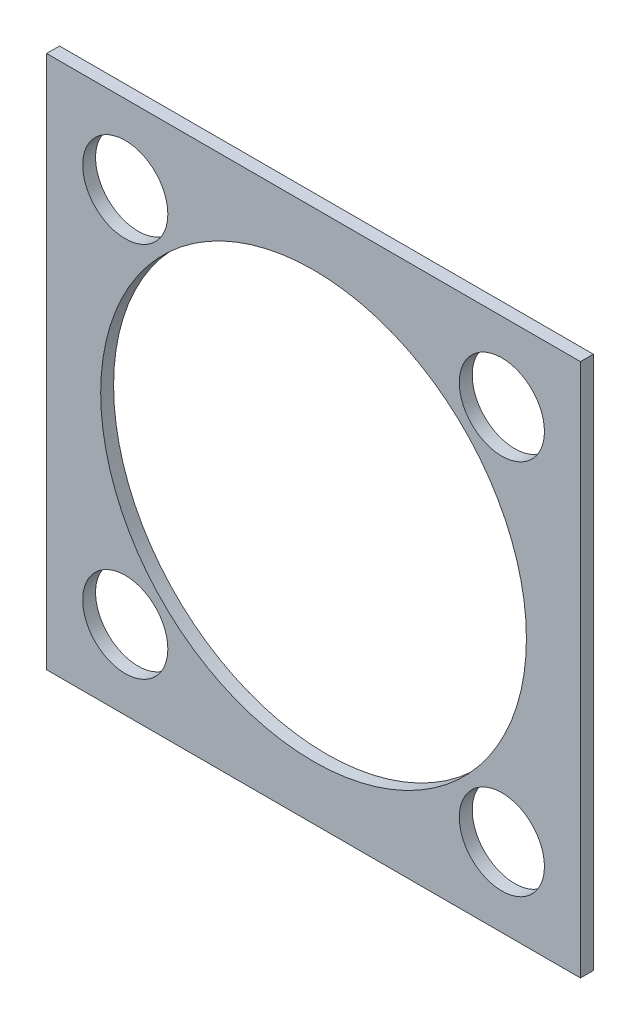
ISO-10303-21;
HEADER;
FILE_DESCRIPTION(('STEP AP214'),'2;1');
FILE_NAME('part.step','',(''),(''),'','','');
FILE_SCHEMA(('AUTOMOTIVE_DESIGN { 1 0 10303 214 1 1 1 1 }'));
ENDSEC;
DATA;
#1=APPLICATION_CONTEXT('core data for automotive mechanical design processes');
#2=APPLICATION_PROTOCOL_DEFINITION('international standard','automotive_design',2000,#1);
#3=PRODUCT_CONTEXT('',#1,'mechanical');
#4=PRODUCT('Part','Part','',(#3));
#5=PRODUCT_RELATED_PRODUCT_CATEGORY('part','',(#4));
#6=PRODUCT_DEFINITION_FORMATION('','',#4);
#7=PRODUCT_DEFINITION_CONTEXT('part definition',#1,'design');
#8=PRODUCT_DEFINITION('design','',#6,#7);
#9=PRODUCT_DEFINITION_SHAPE('','',#8);
#10=(LENGTH_UNIT() NAMED_UNIT(*) SI_UNIT(.MILLI.,.METRE.));
#11=(NAMED_UNIT(*) PLANE_ANGLE_UNIT() SI_UNIT($,.RADIAN.));
#12=(NAMED_UNIT(*) SI_UNIT($,.STERADIAN.) SOLID_ANGLE_UNIT());
#13=UNCERTAINTY_MEASURE_WITH_UNIT(LENGTH_MEASURE(1.E-05),#10,'distance_accuracy_value','');
#14=(GEOMETRIC_REPRESENTATION_CONTEXT(3) GLOBAL_UNCERTAINTY_ASSIGNED_CONTEXT((#13)) GLOBAL_UNIT_ASSIGNED_CONTEXT((#10,
#11,#12)) REPRESENTATION_CONTEXT('',''));
#15=CARTESIAN_POINT('',(0.,0.,0.));
#16=DIRECTION('',(0.,0.,1.));
#17=DIRECTION('',(1.,0.,0.));
#18=AXIS2_PLACEMENT_3D('',#15,#16,#17);
#19=CARTESIAN_POINT('',(-20.701,20.701,-0.499999));
#20=DIRECTION('',(-1.,0.,0.));
#21=DIRECTION('',(0.,0.,1.));
#22=AXIS2_PLACEMENT_3D('',#19,#20,#21);
#23=PLANE('',#22);
#24=DIRECTION('',(0.,0.,1.));
#25=VECTOR('',#24,1.);
#26=CARTESIAN_POINT('',(-20.701,-20.701,-0.499999));
#27=LINE('',#26,#25);
#28=CARTESIAN_POINT('',(-20.701,-20.701,-0.499999));
#29=VERTEX_POINT('',#28);
#30=CARTESIAN_POINT('',(-20.701,-20.701,0.499999));
#31=VERTEX_POINT('',#30);
#32=EDGE_CURVE('E38',#29,#31,#27,.T.);
#33=ORIENTED_EDGE('',*,*,#32,.T.);
#34=DIRECTION('',(0.,-1.,0.));
#35=VECTOR('',#34,1.);
#36=CARTESIAN_POINT('',(-20.701,20.701,0.499999));
#37=LINE('',#36,#35);
#38=CARTESIAN_POINT('',(-20.701,20.701,0.499999));
#39=VERTEX_POINT('',#38);
#40=EDGE_CURVE('E75',#39,#31,#37,.T.);
#41=ORIENTED_EDGE('',*,*,#40,.F.);
#42=DIRECTION('',(0.,0.,1.));
#43=VECTOR('',#42,1.);
#44=CARTESIAN_POINT('',(-20.701,20.701,-0.499999));
#45=LINE('',#44,#43);
#46=CARTESIAN_POINT('',(-20.701,20.701,-0.499999));
#47=VERTEX_POINT('',#46);
#48=EDGE_CURVE('E11',#47,#39,#45,.T.);
#49=ORIENTED_EDGE('',*,*,#48,.F.);
#50=DIRECTION('',(0.,-1.,0.));
#51=VECTOR('',#50,1.);
#52=CARTESIAN_POINT('',(-20.701,20.701,-0.499999));
#53=LINE('',#52,#51);
#54=EDGE_CURVE('E76',#47,#29,#53,.T.);
#55=ORIENTED_EDGE('',*,*,#54,.T.);
#56=EDGE_LOOP('',(#33,#41,#49,#55));
#57=FACE_BOUND('',#56,.T.);
#58=ADVANCED_FACE('F35',(#57),#23,.T.);
#59=CARTESIAN_POINT('',(-20.701,20.701,-0.499999));
#60=DIRECTION('',(0.,1.,0.));
#61=DIRECTION('',(0.,0.,1.));
#62=AXIS2_PLACEMENT_3D('',#59,#60,#61);
#63=PLANE('',#62);
#64=ORIENTED_EDGE('',*,*,#48,.T.);
#65=DIRECTION('',(-1.,0.,0.));
#66=VECTOR('',#65,1.);
#67=CARTESIAN_POINT('',(-20.701,20.701,0.499999));
#68=LINE('',#67,#66);
#69=CARTESIAN_POINT('',(20.701,20.701,0.499999));
#70=VERTEX_POINT('',#69);
#71=EDGE_CURVE('E92',#70,#39,#68,.T.);
#72=ORIENTED_EDGE('',*,*,#71,.F.);
#73=DIRECTION('',(0.,0.,1.));
#74=VECTOR('',#73,1.);
#75=CARTESIAN_POINT('',(20.701,20.701,-0.499999));
#76=LINE('',#75,#74);
#77=CARTESIAN_POINT('',(20.701,20.701,-0.499999));
#78=VERTEX_POINT('',#77);
#79=EDGE_CURVE('E43',#78,#70,#76,.T.);
#80=ORIENTED_EDGE('',*,*,#79,.F.);
#81=DIRECTION('',(-1.,0.,0.));
#82=VECTOR('',#81,1.);
#83=CARTESIAN_POINT('',(-20.701,20.701,-0.499999));
#84=LINE('',#83,#82);
#85=EDGE_CURVE('E81',#78,#47,#84,.T.);
#86=ORIENTED_EDGE('',*,*,#85,.T.);
#87=EDGE_LOOP('',(#64,#72,#80,#86));
#88=FACE_BOUND('',#87,.T.);
#89=ADVANCED_FACE('F112',(#88),#63,.T.);
#90=CARTESIAN_POINT('',(20.701,20.701,-0.499999));
#91=DIRECTION('',(1.,0.,0.));
#92=DIRECTION('',(0.,1.,0.));
#93=AXIS2_PLACEMENT_3D('',#90,#91,#92);
#94=PLANE('',#93);
#95=ORIENTED_EDGE('',*,*,#79,.T.);
#96=DIRECTION('',(0.,1.,0.));
#97=VECTOR('',#96,1.);
#98=CARTESIAN_POINT('',(20.701,20.701,0.499999));
#99=LINE('',#98,#97);
#100=CARTESIAN_POINT('',(20.701,-20.701,0.499999));
#101=VERTEX_POINT('',#100);
#102=EDGE_CURVE('E88',#101,#70,#99,.T.);
#103=ORIENTED_EDGE('',*,*,#102,.F.);
#104=DIRECTION('',(0.,0.,1.));
#105=VECTOR('',#104,1.);
#106=CARTESIAN_POINT('',(20.701,-20.701,-0.499999));
#107=LINE('',#106,#105);
#108=CARTESIAN_POINT('',(20.701,-20.701,-0.499999));
#109=VERTEX_POINT('',#108);
#110=EDGE_CURVE('E80',#109,#101,#107,.T.);
#111=ORIENTED_EDGE('',*,*,#110,.F.);
#112=DIRECTION('',(0.,1.,0.));
#113=VECTOR('',#112,1.);
#114=CARTESIAN_POINT('',(20.701,20.701,-0.499999));
#115=LINE('',#114,#113);
#116=EDGE_CURVE('E105',#109,#78,#115,.T.);
#117=ORIENTED_EDGE('',*,*,#116,.T.);
#118=EDGE_LOOP('',(#95,#103,#111,#117));
#119=FACE_BOUND('',#118,.T.);
#120=ADVANCED_FACE('F109',(#119),#94,.T.);
#121=CARTESIAN_POINT('',(-20.701,-20.701,-0.499999));
#122=DIRECTION('',(0.,-1.,0.));
#123=DIRECTION('',(0.,0.,-1.));
#124=AXIS2_PLACEMENT_3D('',#121,#122,#123);
#125=PLANE('',#124);
#126=ORIENTED_EDGE('',*,*,#110,.T.);
#127=DIRECTION('',(1.,0.,0.));
#128=VECTOR('',#127,1.);
#129=CARTESIAN_POINT('',(-20.701,-20.701,0.499999));
#130=LINE('',#129,#128);
#131=EDGE_CURVE('E83',#31,#101,#130,.T.);
#132=ORIENTED_EDGE('',*,*,#131,.F.);
#133=ORIENTED_EDGE('',*,*,#32,.F.);
#134=DIRECTION('',(1.,0.,0.));
#135=VECTOR('',#134,1.);
#136=CARTESIAN_POINT('',(-20.701,-20.701,-0.499999));
#137=LINE('',#136,#135);
#138=EDGE_CURVE('E103',#29,#109,#137,.T.);
#139=ORIENTED_EDGE('',*,*,#138,.T.);
#140=EDGE_LOOP('',(#126,#132,#133,#139));
#141=FACE_BOUND('',#140,.T.);
#142=ADVANCED_FACE('F84',(#141),#125,.T.);
#143=CARTESIAN_POINT('',(0.,0.,-0.499999));
#144=DIRECTION('',(0.,0.,1.));
#145=DIRECTION('',(1.,0.,0.));
#146=AXIS2_PLACEMENT_3D('',#143,#144,#145);
#147=PLANE('',#146);
#148=CARTESIAN_POINT('',(14.605,-14.605,-0.499999));
#149=DIRECTION('',(0.,0.,-1.));
#150=DIRECTION('',(1.,0.,0.));
#151=AXIS2_PLACEMENT_3D('',#148,#149,#150);
#152=CIRCLE('',#151,3.302);
#153=CARTESIAN_POINT('',(17.907,-14.605,-0.499999));
#154=VERTEX_POINT('',#153);
#155=EDGE_CURVE('E207',#154,#154,#152,.T.);
#156=ORIENTED_EDGE('',*,*,#155,.F.);
#157=EDGE_LOOP('',(#156));
#158=FACE_BOUND('',#157,.T.);
#159=CARTESIAN_POINT('',(-14.605,-14.605,-0.499999));
#160=DIRECTION('',(0.,0.,-1.));
#161=DIRECTION('',(1.,0.,0.));
#162=AXIS2_PLACEMENT_3D('',#159,#160,#161);
#163=CIRCLE('',#162,3.302);
#164=CARTESIAN_POINT('',(-11.303,-14.605,-0.499999));
#165=VERTEX_POINT('',#164);
#166=EDGE_CURVE('E215',#165,#165,#163,.T.);
#167=ORIENTED_EDGE('',*,*,#166,.F.);
#168=EDGE_LOOP('',(#167));
#169=FACE_BOUND('',#168,.T.);
#170=CARTESIAN_POINT('',(14.605,14.605,-0.499999));
#171=DIRECTION('',(0.,0.,1.));
#172=DIRECTION('',(1.,0.,0.));
#173=AXIS2_PLACEMENT_3D('',#170,#171,#172);
#174=CIRCLE('',#173,3.302);
#175=CARTESIAN_POINT('',(17.907,14.605,-0.499999));
#176=VERTEX_POINT('',#175);
#177=EDGE_CURVE('E221',#176,#176,#174,.T.);
#178=ORIENTED_EDGE('',*,*,#177,.T.);
#179=EDGE_LOOP('',(#178));
#180=FACE_BOUND('',#179,.T.);
#181=CARTESIAN_POINT('',(-14.605,14.605,-0.499999));
#182=DIRECTION('',(0.,0.,1.));
#183=DIRECTION('',(1.,0.,0.));
#184=AXIS2_PLACEMENT_3D('',#181,#182,#183);
#185=CIRCLE('',#184,3.302);
#186=CARTESIAN_POINT('',(-11.303,14.605,-0.499999));
#187=VERTEX_POINT('',#186);
#188=EDGE_CURVE('E227',#187,#187,#185,.T.);
#189=ORIENTED_EDGE('',*,*,#188,.T.);
#190=EDGE_LOOP('',(#189));
#191=FACE_BOUND('',#190,.T.);
#192=CARTESIAN_POINT('',(0.,0.,-0.499999));
#193=DIRECTION('',(0.,0.,1.));
#194=DIRECTION('',(1.,0.,0.));
#195=AXIS2_PLACEMENT_3D('',#192,#193,#194);
#196=CIRCLE('',#195,16.51);
#197=CARTESIAN_POINT('',(16.51,0.,-0.499999));
#198=VERTEX_POINT('',#197);
#199=EDGE_CURVE('E93',#198,#198,#196,.T.);
#200=ORIENTED_EDGE('',*,*,#199,.T.);
#201=EDGE_LOOP('',(#200));
#202=FACE_BOUND('',#201,.T.);
#203=ORIENTED_EDGE('',*,*,#54,.F.);
#204=ORIENTED_EDGE('',*,*,#85,.F.);
#205=ORIENTED_EDGE('',*,*,#116,.F.);
#206=ORIENTED_EDGE('',*,*,#138,.F.);
#207=EDGE_LOOP('',(#203,#204,#205,#206));
#208=FACE_BOUND('',#207,.T.);
#209=ADVANCED_FACE('F114',(#158,#169,#180,#191,#202,#208),#147,.F.);
#210=CARTESIAN_POINT('',(0.,0.,0.499999));
#211=DIRECTION('',(0.,0.,1.));
#212=DIRECTION('',(1.,0.,0.));
#213=AXIS2_PLACEMENT_3D('',#210,#211,#212);
#214=PLANE('',#213);
#215=CARTESIAN_POINT('',(14.605,-14.605,0.499999));
#216=DIRECTION('',(0.,0.,-1.));
#217=DIRECTION('',(1.,0.,0.));
#218=AXIS2_PLACEMENT_3D('',#215,#216,#217);
#219=CIRCLE('',#218,3.302);
#220=CARTESIAN_POINT('',(17.907,-14.605,0.499999));
#221=VERTEX_POINT('',#220);
#222=EDGE_CURVE('E210',#221,#221,#219,.T.);
#223=ORIENTED_EDGE('',*,*,#222,.T.);
#224=EDGE_LOOP('',(#223));
#225=FACE_BOUND('',#224,.T.);
#226=CARTESIAN_POINT('',(-14.605,-14.605,0.499999));
#227=DIRECTION('',(0.,0.,-1.));
#228=DIRECTION('',(1.,0.,0.));
#229=AXIS2_PLACEMENT_3D('',#226,#227,#228);
#230=CIRCLE('',#229,3.302);
#231=CARTESIAN_POINT('',(-11.303,-14.605,0.499999));
#232=VERTEX_POINT('',#231);
#233=EDGE_CURVE('E212',#232,#232,#230,.T.);
#234=ORIENTED_EDGE('',*,*,#233,.T.);
#235=EDGE_LOOP('',(#234));
#236=FACE_BOUND('',#235,.T.);
#237=CARTESIAN_POINT('',(14.605,14.605,0.499999));
#238=DIRECTION('',(0.,0.,1.));
#239=DIRECTION('',(1.,0.,0.));
#240=AXIS2_PLACEMENT_3D('',#237,#238,#239);
#241=CIRCLE('',#240,3.302);
#242=CARTESIAN_POINT('',(17.907,14.605,0.499999));
#243=VERTEX_POINT('',#242);
#244=EDGE_CURVE('E218',#243,#243,#241,.T.);
#245=ORIENTED_EDGE('',*,*,#244,.F.);
#246=EDGE_LOOP('',(#245));
#247=FACE_BOUND('',#246,.T.);
#248=CARTESIAN_POINT('',(-14.605,14.605,0.499999));
#249=DIRECTION('',(0.,0.,1.));
#250=DIRECTION('',(1.,0.,0.));
#251=AXIS2_PLACEMENT_3D('',#248,#249,#250);
#252=CIRCLE('',#251,3.302);
#253=CARTESIAN_POINT('',(-11.303,14.605,0.499999));
#254=VERTEX_POINT('',#253);
#255=EDGE_CURVE('E224',#254,#254,#252,.T.);
#256=ORIENTED_EDGE('',*,*,#255,.F.);
#257=EDGE_LOOP('',(#256));
#258=FACE_BOUND('',#257,.T.);
#259=CARTESIAN_POINT('',(0.,0.,0.499999));
#260=DIRECTION('',(0.,0.,1.));
#261=DIRECTION('',(1.,0.,0.));
#262=AXIS2_PLACEMENT_3D('',#259,#260,#261);
#263=CIRCLE('',#262,16.51);
#264=CARTESIAN_POINT('',(16.51,0.,0.499999));
#265=VERTEX_POINT('',#264);
#266=EDGE_CURVE('E96',#265,#265,#263,.T.);
#267=ORIENTED_EDGE('',*,*,#266,.F.);
#268=EDGE_LOOP('',(#267));
#269=FACE_BOUND('',#268,.T.);
#270=ORIENTED_EDGE('',*,*,#40,.T.);
#271=ORIENTED_EDGE('',*,*,#131,.T.);
#272=ORIENTED_EDGE('',*,*,#102,.T.);
#273=ORIENTED_EDGE('',*,*,#71,.T.);
#274=EDGE_LOOP('',(#270,#271,#272,#273));
#275=FACE_BOUND('',#274,.T.);
#276=ADVANCED_FACE('F91',(#225,#236,#247,#258,#269,#275),#214,.T.);
#277=CARTESIAN_POINT('',(0.,0.,-0.499999));
#278=DIRECTION('',(0.,0.,1.));
#279=DIRECTION('',(1.,0.,0.));
#280=AXIS2_PLACEMENT_3D('',#277,#278,#279);
#281=CYLINDRICAL_SURFACE('',#280,16.51);
#282=ORIENTED_EDGE('',*,*,#199,.F.);
#283=EDGE_LOOP('',(#282));
#284=FACE_BOUND('',#283,.T.);
#285=ORIENTED_EDGE('',*,*,#266,.T.);
#286=EDGE_LOOP('',(#285));
#287=FACE_BOUND('',#286,.T.);
#288=ADVANCED_FACE('F122',(#284,#287),#281,.F.);
#289=CARTESIAN_POINT('',(-14.605,14.605,-0.499999));
#290=DIRECTION('',(0.,0.,1.));
#291=DIRECTION('',(1.,0.,0.));
#292=AXIS2_PLACEMENT_3D('',#289,#290,#291);
#293=CYLINDRICAL_SURFACE('',#292,3.302);
#294=ORIENTED_EDGE('',*,*,#188,.F.);
#295=EDGE_LOOP('',(#294));
#296=FACE_BOUND('',#295,.T.);
#297=ORIENTED_EDGE('',*,*,#255,.T.);
#298=EDGE_LOOP('',(#297));
#299=FACE_BOUND('',#298,.T.);
#300=ADVANCED_FACE('F152',(#296,#299),#293,.F.);
#301=CARTESIAN_POINT('',(14.605,14.605,-0.499999));
#302=DIRECTION('',(0.,0.,1.));
#303=DIRECTION('',(1.,0.,0.));
#304=AXIS2_PLACEMENT_3D('',#301,#302,#303);
#305=CYLINDRICAL_SURFACE('',#304,3.302);
#306=ORIENTED_EDGE('',*,*,#177,.F.);
#307=EDGE_LOOP('',(#306));
#308=FACE_BOUND('',#307,.T.);
#309=ORIENTED_EDGE('',*,*,#244,.T.);
#310=EDGE_LOOP('',(#309));
#311=FACE_BOUND('',#310,.T.);
#312=ADVANCED_FACE('F163',(#308,#311),#305,.F.);
#313=CARTESIAN_POINT('',(-14.605,-14.605,-0.499999));
#314=DIRECTION('',(0.,0.,1.));
#315=DIRECTION('',(1.,0.,0.));
#316=AXIS2_PLACEMENT_3D('',#313,#314,#315);
#317=CYLINDRICAL_SURFACE('',#316,3.302);
#318=ORIENTED_EDGE('',*,*,#166,.T.);
#319=EDGE_LOOP('',(#318));
#320=FACE_BOUND('',#319,.T.);
#321=ORIENTED_EDGE('',*,*,#233,.F.);
#322=EDGE_LOOP('',(#321));
#323=FACE_BOUND('',#322,.T.);
#324=ADVANCED_FACE('F172',(#320,#323),#317,.F.);
#325=CARTESIAN_POINT('',(14.605,-14.605,-0.499999));
#326=DIRECTION('',(0.,0.,1.));
#327=DIRECTION('',(1.,0.,0.));
#328=AXIS2_PLACEMENT_3D('',#325,#326,#327);
#329=CYLINDRICAL_SURFACE('',#328,3.302);
#330=ORIENTED_EDGE('',*,*,#155,.T.);
#331=EDGE_LOOP('',(#330));
#332=FACE_BOUND('',#331,.T.);
#333=ORIENTED_EDGE('',*,*,#222,.F.);
#334=EDGE_LOOP('',(#333));
#335=FACE_BOUND('',#334,.T.);
#336=ADVANCED_FACE('F191',(#332,#335),#329,.F.);
#337=CLOSED_SHELL('',(#58,#89,#120,#142,#209,#276,#288,#300,#312,#324,#336));
#338=MANIFOLD_SOLID_BREP('B2',#337);
#339=ADVANCED_BREP_SHAPE_REPRESENTATION('',(#18,#338),#14);
#340=SHAPE_DEFINITION_REPRESENTATION(#9,#339);
ENDSEC;
END-ISO-10303-21;
